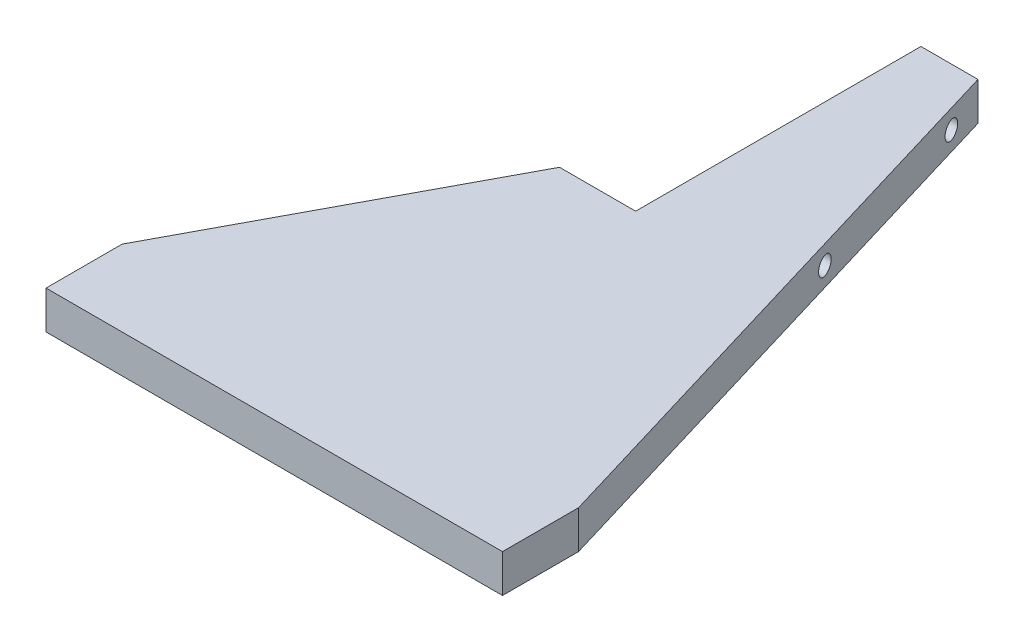
ISO-10303-21;
HEADER;
FILE_DESCRIPTION(('STEP AP214'),'2;1');
FILE_NAME('part.step','',(''),(''),'','','');
FILE_SCHEMA(('AUTOMOTIVE_DESIGN { 1 0 10303 214 1 1 1 1 }'));
ENDSEC;
DATA;
#1=APPLICATION_CONTEXT('core data for automotive mechanical design processes');
#2=APPLICATION_PROTOCOL_DEFINITION('international standard','automotive_design',2000,#1);
#3=PRODUCT_CONTEXT('',#1,'mechanical');
#4=PRODUCT('Part','Part','',(#3));
#5=PRODUCT_RELATED_PRODUCT_CATEGORY('part','',(#4));
#6=PRODUCT_DEFINITION_FORMATION('','',#4);
#7=PRODUCT_DEFINITION_CONTEXT('part definition',#1,'design');
#8=PRODUCT_DEFINITION('design','',#6,#7);
#9=PRODUCT_DEFINITION_SHAPE('','',#8);
#10=(LENGTH_UNIT() NAMED_UNIT(*) SI_UNIT(.MILLI.,.METRE.));
#11=(NAMED_UNIT(*) PLANE_ANGLE_UNIT() SI_UNIT($,.RADIAN.));
#12=(NAMED_UNIT(*) SI_UNIT($,.STERADIAN.) SOLID_ANGLE_UNIT());
#13=UNCERTAINTY_MEASURE_WITH_UNIT(LENGTH_MEASURE(1.E-05),#10,'distance_accuracy_value','');
#14=(GEOMETRIC_REPRESENTATION_CONTEXT(3) GLOBAL_UNCERTAINTY_ASSIGNED_CONTEXT((#13)) GLOBAL_UNIT_ASSIGNED_CONTEXT((#10,
#11,#12)) REPRESENTATION_CONTEXT('',''));
#15=CARTESIAN_POINT('',(0.,0.,0.));
#16=DIRECTION('',(0.,0.,1.));
#17=DIRECTION('',(1.,0.,0.));
#18=AXIS2_PLACEMENT_3D('',#15,#16,#17);
#19=CARTESIAN_POINT('',(0.,6.35,0.));
#20=DIRECTION('',(-1.,0.,0.));
#21=DIRECTION('',(0.,0.,1.));
#22=AXIS2_PLACEMENT_3D('',#19,#20,#21);
#23=PLANE('',#22);
#24=DIRECTION('',(0.,0.,-1.));
#25=VECTOR('',#24,1.);
#26=CARTESIAN_POINT('',(0.,0.,0.));
#27=LINE('',#26,#25);
#28=CARTESIAN_POINT('',(0.,0.,0.));
#29=VERTEX_POINT('',#28);
#30=CARTESIAN_POINT('',(0.,0.,-12.7));
#31=VERTEX_POINT('',#30);
#32=EDGE_CURVE('E143',#29,#31,#27,.T.);
#33=ORIENTED_EDGE('',*,*,#32,.F.);
#34=DIRECTION('',(0.,-1.,0.));
#35=VECTOR('',#34,1.);
#36=CARTESIAN_POINT('',(0.,6.35,0.));
#37=LINE('',#36,#35);
#38=CARTESIAN_POINT('',(0.,6.35,0.));
#39=VERTEX_POINT('',#38);
#40=EDGE_CURVE('E11',#39,#29,#37,.T.);
#41=ORIENTED_EDGE('',*,*,#40,.F.);
#42=DIRECTION('',(0.,0.,-1.));
#43=VECTOR('',#42,1.);
#44=CARTESIAN_POINT('',(0.,6.35,0.));
#45=LINE('',#44,#43);
#46=CARTESIAN_POINT('',(0.,6.35,-12.7));
#47=VERTEX_POINT('',#46);
#48=EDGE_CURVE('E171',#39,#47,#45,.T.);
#49=ORIENTED_EDGE('',*,*,#48,.T.);
#50=DIRECTION('',(0.,-1.,0.));
#51=VECTOR('',#50,1.);
#52=CARTESIAN_POINT('',(0.,6.35,-12.7));
#53=LINE('',#52,#51);
#54=EDGE_CURVE('E95',#47,#31,#53,.T.);
#55=ORIENTED_EDGE('',*,*,#54,.T.);
#56=EDGE_LOOP('',(#33,#41,#49,#55));
#57=FACE_BOUND('',#56,.T.);
#58=ADVANCED_FACE('F38',(#57),#23,.T.);
#59=CARTESIAN_POINT('',(0.,6.35,0.));
#60=DIRECTION('',(0.,0.,-1.));
#61=DIRECTION('',(-1.,0.,0.));
#62=AXIS2_PLACEMENT_3D('',#59,#60,#61);
#63=PLANE('',#62);
#64=DIRECTION('',(1.,0.,0.));
#65=VECTOR('',#64,1.);
#66=CARTESIAN_POINT('',(0.,0.,0.));
#67=LINE('',#66,#65);
#68=CARTESIAN_POINT('',(76.2,0.,0.));
#69=VERTEX_POINT('',#68);
#70=EDGE_CURVE('E169',#29,#69,#67,.T.);
#71=ORIENTED_EDGE('',*,*,#70,.T.);
#72=DIRECTION('',(0.,-1.,0.));
#73=VECTOR('',#72,1.);
#74=CARTESIAN_POINT('',(76.2,6.35,0.));
#75=LINE('',#74,#73);
#76=CARTESIAN_POINT('',(76.2,6.35,0.));
#77=VERTEX_POINT('',#76);
#78=EDGE_CURVE('E48',#77,#69,#75,.T.);
#79=ORIENTED_EDGE('',*,*,#78,.F.);
#80=DIRECTION('',(1.,0.,0.));
#81=VECTOR('',#80,1.);
#82=CARTESIAN_POINT('',(0.,6.35,0.));
#83=LINE('',#82,#81);
#84=EDGE_CURVE('E129',#39,#77,#83,.T.);
#85=ORIENTED_EDGE('',*,*,#84,.F.);
#86=ORIENTED_EDGE('',*,*,#40,.T.);
#87=EDGE_LOOP('',(#71,#79,#85,#86));
#88=FACE_BOUND('',#87,.T.);
#89=ADVANCED_FACE('F226',(#88),#63,.F.);
#90=CARTESIAN_POINT('',(76.2,6.35,-12.7));
#91=DIRECTION('',(1.,0.,0.));
#92=DIRECTION('',(0.,0.,-1.));
#93=AXIS2_PLACEMENT_3D('',#90,#91,#92);
#94=PLANE('',#93);
#95=DIRECTION('',(0.,0.,1.));
#96=VECTOR('',#95,1.);
#97=CARTESIAN_POINT('',(76.2,0.,-12.7));
#98=LINE('',#97,#96);
#99=CARTESIAN_POINT('',(76.2,0.,-12.7));
#100=VERTEX_POINT('',#99);
#101=EDGE_CURVE('E114',#100,#69,#98,.T.);
#102=ORIENTED_EDGE('',*,*,#101,.F.);
#103=DIRECTION('',(0.,-1.,0.));
#104=VECTOR('',#103,1.);
#105=CARTESIAN_POINT('',(76.2,6.35,-12.7));
#106=LINE('',#105,#104);
#107=CARTESIAN_POINT('',(76.2,6.35,-12.7));
#108=VERTEX_POINT('',#107);
#109=EDGE_CURVE('E109',#108,#100,#106,.T.);
#110=ORIENTED_EDGE('',*,*,#109,.F.);
#111=DIRECTION('',(0.,0.,1.));
#112=VECTOR('',#111,1.);
#113=CARTESIAN_POINT('',(76.2,6.35,-12.7));
#114=LINE('',#113,#112);
#115=EDGE_CURVE('E112',#108,#77,#114,.T.);
#116=ORIENTED_EDGE('',*,*,#115,.T.);
#117=ORIENTED_EDGE('',*,*,#78,.T.);
#118=EDGE_LOOP('',(#102,#110,#116,#117));
#119=FACE_BOUND('',#118,.T.);
#120=ADVANCED_FACE('F111',(#119),#94,.T.);
#121=CARTESIAN_POINT('',(47.625,6.35,-107.95));
#122=DIRECTION('',(0.957826285221151,0.,-0.287347885566345));
#123=DIRECTION('',(-0.287347885566345,0.,-0.957826285221152));
#124=AXIS2_PLACEMENT_3D('',#121,#122,#123);
#125=PLANE('',#124);
#126=CARTESIAN_POINT('',(49.53,3.175,-101.6));
#127=DIRECTION('',(0.957826285221151,0.,-0.287347885566345));
#128=DIRECTION('',(-0.287347885566345,0.,-0.957826285221152));
#129=AXIS2_PLACEMENT_3D('',#126,#127,#128);
#130=ELLIPSE('',#129,1.56604597633658,1.5);
#131=CARTESIAN_POINT('',(49.08,3.175,-103.1));
#132=VERTEX_POINT('',#131);
#133=EDGE_CURVE('E148',#132,#132,#130,.T.);
#134=ORIENTED_EDGE('',*,*,#133,.F.);
#135=EDGE_LOOP('',(#134));
#136=FACE_BOUND('',#135,.T.);
#137=CARTESIAN_POINT('',(58.57875,3.175,-71.4375));
#138=DIRECTION('',(0.957826285221151,0.,-0.287347885566345));
#139=DIRECTION('',(-0.287347885566345,0.,-0.957826285221152));
#140=AXIS2_PLACEMENT_3D('',#137,#138,#139);
#141=ELLIPSE('',#140,1.56604597633658,1.5);
#142=CARTESIAN_POINT('',(58.12875,3.175,-72.9375));
#143=VERTEX_POINT('',#142);
#144=EDGE_CURVE('E190',#143,#143,#141,.T.);
#145=ORIENTED_EDGE('',*,*,#144,.F.);
#146=EDGE_LOOP('',(#145));
#147=FACE_BOUND('',#146,.T.);
#148=DIRECTION('',(0.287347885566345,0.,0.957826285221151));
#149=VECTOR('',#148,1.);
#150=CARTESIAN_POINT('',(47.625,0.,-107.95));
#151=LINE('',#150,#149);
#152=CARTESIAN_POINT('',(47.625,0.,-107.95));
#153=VERTEX_POINT('',#152);
#154=EDGE_CURVE('E164',#153,#100,#151,.T.);
#155=ORIENTED_EDGE('',*,*,#154,.F.);
#156=DIRECTION('',(0.,-1.,0.));
#157=VECTOR('',#156,1.);
#158=CARTESIAN_POINT('',(47.625,6.35,-107.95));
#159=LINE('',#158,#157);
#160=CARTESIAN_POINT('',(47.625,6.35,-107.95));
#161=VERTEX_POINT('',#160);
#162=EDGE_CURVE('E120',#161,#153,#159,.T.);
#163=ORIENTED_EDGE('',*,*,#162,.F.);
#164=DIRECTION('',(0.287347885566345,0.,0.957826285221151));
#165=VECTOR('',#164,1.);
#166=CARTESIAN_POINT('',(47.625,6.35,-107.95));
#167=LINE('',#166,#165);
#168=EDGE_CURVE('E127',#161,#108,#167,.T.);
#169=ORIENTED_EDGE('',*,*,#168,.T.);
#170=ORIENTED_EDGE('',*,*,#109,.T.);
#171=EDGE_LOOP('',(#155,#163,#169,#170));
#172=FACE_BOUND('',#171,.T.);
#173=ADVANCED_FACE('F132',(#136,#147,#172),#125,.T.);
#174=CARTESIAN_POINT('',(38.1,6.35,-107.95));
#175=DIRECTION('',(0.,0.,-1.));
#176=DIRECTION('',(-1.,0.,0.));
#177=AXIS2_PLACEMENT_3D('',#174,#175,#176);
#178=PLANE('',#177);
#179=DIRECTION('',(1.,0.,0.));
#180=VECTOR('',#179,1.);
#181=CARTESIAN_POINT('',(38.1,0.,-107.95));
#182=LINE('',#181,#180);
#183=CARTESIAN_POINT('',(38.1,0.,-107.95));
#184=VERTEX_POINT('',#183);
#185=EDGE_CURVE('E160',#184,#153,#182,.T.);
#186=ORIENTED_EDGE('',*,*,#185,.F.);
#187=DIRECTION('',(0.,-1.,0.));
#188=VECTOR('',#187,1.);
#189=CARTESIAN_POINT('',(38.1,6.35,-107.95));
#190=LINE('',#189,#188);
#191=CARTESIAN_POINT('',(38.1,6.35,-107.95));
#192=VERTEX_POINT('',#191);
#193=EDGE_CURVE('E177',#192,#184,#190,.T.);
#194=ORIENTED_EDGE('',*,*,#193,.F.);
#195=DIRECTION('',(1.,0.,0.));
#196=VECTOR('',#195,1.);
#197=CARTESIAN_POINT('',(38.1,6.35,-107.95));
#198=LINE('',#197,#196);
#199=EDGE_CURVE('E134',#192,#161,#198,.T.);
#200=ORIENTED_EDGE('',*,*,#199,.T.);
#201=ORIENTED_EDGE('',*,*,#162,.T.);
#202=EDGE_LOOP('',(#186,#194,#200,#201));
#203=FACE_BOUND('',#202,.T.);
#204=ADVANCED_FACE('F239',(#203),#178,.T.);
#205=CARTESIAN_POINT('',(38.1,6.35,-60.325));
#206=DIRECTION('',(-1.,0.,0.));
#207=DIRECTION('',(0.,0.,1.));
#208=AXIS2_PLACEMENT_3D('',#205,#206,#207);
#209=PLANE('',#208);
#210=CARTESIAN_POINT('',(38.1,3.175,-101.6));
#211=DIRECTION('',(-1.,0.,0.));
#212=DIRECTION('',(0.,0.,1.));
#213=AXIS2_PLACEMENT_3D('',#210,#211,#212);
#214=CIRCLE('',#213,1.5);
#215=CARTESIAN_POINT('',(38.1,3.175,-100.1));
#216=VERTEX_POINT('',#215);
#217=EDGE_CURVE('E41',#216,#216,#214,.T.);
#218=ORIENTED_EDGE('',*,*,#217,.F.);
#219=EDGE_LOOP('',(#218));
#220=FACE_BOUND('',#219,.T.);
#221=CARTESIAN_POINT('',(38.1,3.175,-71.4375));
#222=DIRECTION('',(-1.,0.,0.));
#223=DIRECTION('',(0.,0.,1.));
#224=AXIS2_PLACEMENT_3D('',#221,#222,#223);
#225=CIRCLE('',#224,1.5);
#226=CARTESIAN_POINT('',(38.1,3.175,-69.9375));
#227=VERTEX_POINT('',#226);
#228=EDGE_CURVE('E187',#227,#227,#225,.T.);
#229=ORIENTED_EDGE('',*,*,#228,.F.);
#230=EDGE_LOOP('',(#229));
#231=FACE_BOUND('',#230,.T.);
#232=DIRECTION('',(0.,0.,-1.));
#233=VECTOR('',#232,1.);
#234=CARTESIAN_POINT('',(38.1,0.,-60.325));
#235=LINE('',#234,#233);
#236=CARTESIAN_POINT('',(38.1,0.,-60.325));
#237=VERTEX_POINT('',#236);
#238=EDGE_CURVE('E156',#237,#184,#235,.T.);
#239=ORIENTED_EDGE('',*,*,#238,.F.);
#240=DIRECTION('',(0.,-1.,0.));
#241=VECTOR('',#240,1.);
#242=CARTESIAN_POINT('',(38.1,6.35,-60.325));
#243=LINE('',#242,#241);
#244=CARTESIAN_POINT('',(38.1,6.35,-60.325));
#245=VERTEX_POINT('',#244);
#246=EDGE_CURVE('E180',#245,#237,#243,.T.);
#247=ORIENTED_EDGE('',*,*,#246,.F.);
#248=DIRECTION('',(0.,0.,-1.));
#249=VECTOR('',#248,1.);
#250=CARTESIAN_POINT('',(38.1,6.35,-60.325));
#251=LINE('',#250,#249);
#252=EDGE_CURVE('E137',#245,#192,#251,.T.);
#253=ORIENTED_EDGE('',*,*,#252,.T.);
#254=ORIENTED_EDGE('',*,*,#193,.T.);
#255=EDGE_LOOP('',(#239,#247,#253,#254));
#256=FACE_BOUND('',#255,.T.);
#257=ADVANCED_FACE('F217',(#220,#231,#256),#209,.T.);
#258=CARTESIAN_POINT('',(25.4,6.35,-60.325));
#259=DIRECTION('',(0.,0.,-1.));
#260=DIRECTION('',(-1.,0.,0.));
#261=AXIS2_PLACEMENT_3D('',#258,#259,#260);
#262=PLANE('',#261);
#263=DIRECTION('',(1.,0.,0.));
#264=VECTOR('',#263,1.);
#265=CARTESIAN_POINT('',(25.4,0.,-60.325));
#266=LINE('',#265,#264);
#267=CARTESIAN_POINT('',(25.4,0.,-60.325));
#268=VERTEX_POINT('',#267);
#269=EDGE_CURVE('E152',#268,#237,#266,.T.);
#270=ORIENTED_EDGE('',*,*,#269,.F.);
#271=DIRECTION('',(0.,-1.,0.));
#272=VECTOR('',#271,1.);
#273=CARTESIAN_POINT('',(25.4,6.35,-60.325));
#274=LINE('',#273,#272);
#275=CARTESIAN_POINT('',(25.4,6.35,-60.325));
#276=VERTEX_POINT('',#275);
#277=EDGE_CURVE('E183',#276,#268,#274,.T.);
#278=ORIENTED_EDGE('',*,*,#277,.F.);
#279=DIRECTION('',(1.,0.,0.));
#280=VECTOR('',#279,1.);
#281=CARTESIAN_POINT('',(25.4,6.35,-60.325));
#282=LINE('',#281,#280);
#283=EDGE_CURVE('E209',#276,#245,#282,.T.);
#284=ORIENTED_EDGE('',*,*,#283,.T.);
#285=ORIENTED_EDGE('',*,*,#246,.T.);
#286=EDGE_LOOP('',(#270,#278,#284,#285));
#287=FACE_BOUND('',#286,.T.);
#288=ADVANCED_FACE('F222',(#287),#262,.T.);
#289=CARTESIAN_POINT('',(0.,6.35,-12.7));
#290=DIRECTION('',(-0.88235294117647,0.,-0.470588235294118));
#291=DIRECTION('',(-0.470588235294118,0.,0.882352941176471));
#292=AXIS2_PLACEMENT_3D('',#289,#290,#291);
#293=PLANE('',#292);
#294=DIRECTION('',(0.470588235294118,0.,-0.88235294117647));
#295=VECTOR('',#294,1.);
#296=CARTESIAN_POINT('',(0.,0.,-12.7));
#297=LINE('',#296,#295);
#298=EDGE_CURVE('E147',#31,#268,#297,.T.);
#299=ORIENTED_EDGE('',*,*,#298,.F.);
#300=ORIENTED_EDGE('',*,*,#54,.F.);
#301=DIRECTION('',(0.470588235294118,0.,-0.88235294117647));
#302=VECTOR('',#301,1.);
#303=CARTESIAN_POINT('',(0.,6.35,-12.7));
#304=LINE('',#303,#302);
#305=EDGE_CURVE('E206',#47,#276,#304,.T.);
#306=ORIENTED_EDGE('',*,*,#305,.T.);
#307=ORIENTED_EDGE('',*,*,#277,.T.);
#308=EDGE_LOOP('',(#299,#300,#306,#307));
#309=FACE_BOUND('',#308,.T.);
#310=ADVANCED_FACE('F223',(#309),#293,.T.);
#311=CARTESIAN_POINT('',(0.,6.35,0.));
#312=DIRECTION('',(0.,-1.,0.));
#313=DIRECTION('',(0.,0.,-1.));
#314=AXIS2_PLACEMENT_3D('',#311,#312,#313);
#315=PLANE('',#314);
#316=ORIENTED_EDGE('',*,*,#48,.F.);
#317=ORIENTED_EDGE('',*,*,#84,.T.);
#318=ORIENTED_EDGE('',*,*,#115,.F.);
#319=ORIENTED_EDGE('',*,*,#168,.F.);
#320=ORIENTED_EDGE('',*,*,#199,.F.);
#321=ORIENTED_EDGE('',*,*,#252,.F.);
#322=ORIENTED_EDGE('',*,*,#283,.F.);
#323=ORIENTED_EDGE('',*,*,#305,.F.);
#324=EDGE_LOOP('',(#316,#317,#318,#319,#320,#321,#322,#323));
#325=FACE_BOUND('',#324,.T.);
#326=ADVANCED_FACE('F125',(#325),#315,.F.);
#327=CARTESIAN_POINT('',(0.,0.,0.));
#328=DIRECTION('',(0.,-1.,0.));
#329=DIRECTION('',(0.,0.,-1.));
#330=AXIS2_PLACEMENT_3D('',#327,#328,#329);
#331=PLANE('',#330);
#332=ORIENTED_EDGE('',*,*,#32,.T.);
#333=ORIENTED_EDGE('',*,*,#298,.T.);
#334=ORIENTED_EDGE('',*,*,#269,.T.);
#335=ORIENTED_EDGE('',*,*,#238,.T.);
#336=ORIENTED_EDGE('',*,*,#185,.T.);
#337=ORIENTED_EDGE('',*,*,#154,.T.);
#338=ORIENTED_EDGE('',*,*,#101,.T.);
#339=ORIENTED_EDGE('',*,*,#70,.F.);
#340=EDGE_LOOP('',(#332,#333,#334,#335,#336,#337,#338,#339));
#341=FACE_BOUND('',#340,.T.);
#342=ADVANCED_FACE('F225',(#341),#331,.T.);
#343=CARTESIAN_POINT('',(76.2,3.175,-71.4375));
#344=DIRECTION('',(-1.,0.,0.));
#345=DIRECTION('',(0.,0.,1.));
#346=AXIS2_PLACEMENT_3D('',#343,#344,#345);
#347=CYLINDRICAL_SURFACE('',#346,1.5);
#348=ORIENTED_EDGE('',*,*,#144,.T.);
#349=EDGE_LOOP('',(#348));
#350=FACE_BOUND('',#349,.T.);
#351=ORIENTED_EDGE('',*,*,#228,.T.);
#352=EDGE_LOOP('',(#351));
#353=FACE_BOUND('',#352,.T.);
#354=ADVANCED_FACE('F255',(#350,#353),#347,.F.);
#355=CARTESIAN_POINT('',(76.2,3.175,-101.6));
#356=DIRECTION('',(-1.,0.,0.));
#357=DIRECTION('',(0.,0.,1.));
#358=AXIS2_PLACEMENT_3D('',#355,#356,#357);
#359=CYLINDRICAL_SURFACE('',#358,1.5);
#360=ORIENTED_EDGE('',*,*,#133,.T.);
#361=EDGE_LOOP('',(#360));
#362=FACE_BOUND('',#361,.T.);
#363=ORIENTED_EDGE('',*,*,#217,.T.);
#364=EDGE_LOOP('',(#363));
#365=FACE_BOUND('',#364,.T.);
#366=ADVANCED_FACE('F259',(#362,#365),#359,.F.);
#367=CLOSED_SHELL('',(#58,#89,#120,#173,#204,#257,#288,#310,#326,#342,#354,#366));
#368=MANIFOLD_SOLID_BREP('B2',#367);
#369=ADVANCED_BREP_SHAPE_REPRESENTATION('',(#18,#368),#14);
#370=SHAPE_DEFINITION_REPRESENTATION(#9,#369);
ENDSEC;
END-ISO-10303-21;
